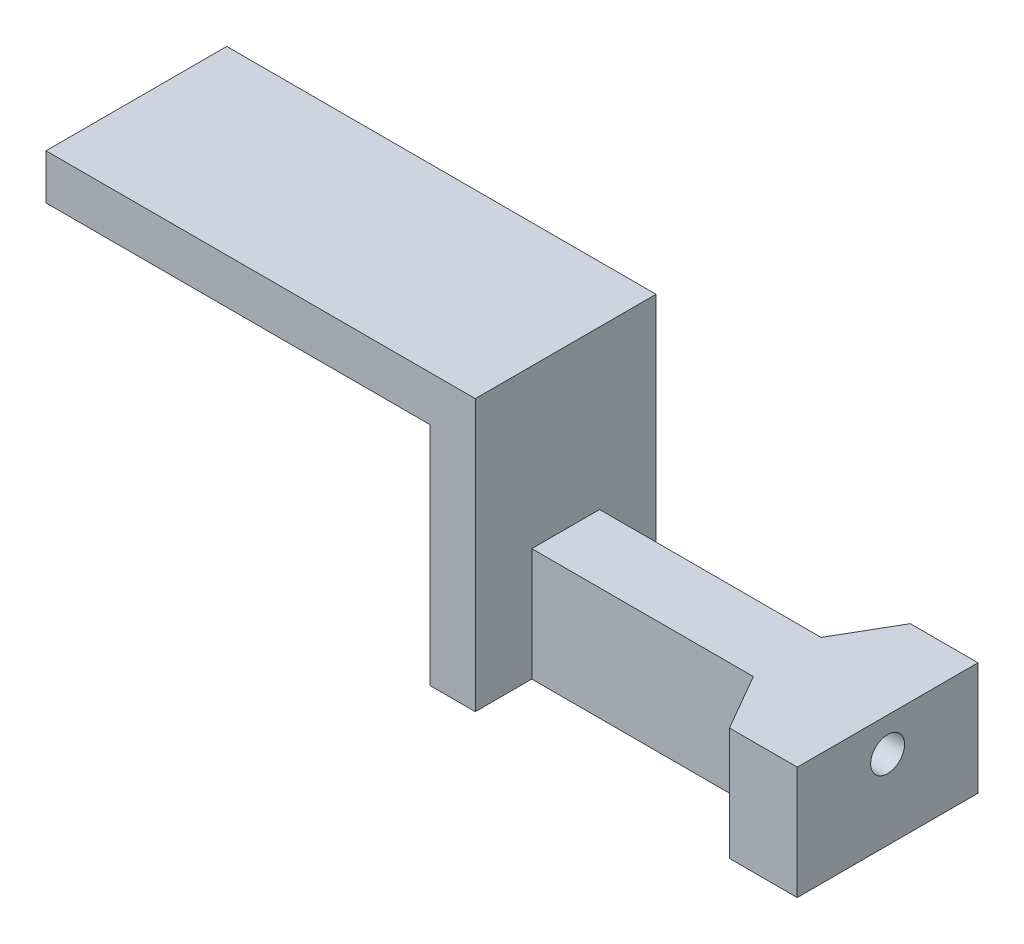
ISO-10303-21;
HEADER;
FILE_DESCRIPTION(('STEP AP214'),'2;1');
FILE_NAME('part.step','',(''),(''),'','','');
FILE_SCHEMA(('AUTOMOTIVE_DESIGN { 1 0 10303 214 1 1 1 1 }'));
ENDSEC;
DATA;
#1=APPLICATION_CONTEXT('core data for automotive mechanical design processes');
#2=APPLICATION_PROTOCOL_DEFINITION('international standard','automotive_design',2000,#1);
#3=PRODUCT_CONTEXT('',#1,'mechanical');
#4=PRODUCT('Part','Part','',(#3));
#5=PRODUCT_RELATED_PRODUCT_CATEGORY('part','',(#4));
#6=PRODUCT_DEFINITION_FORMATION('','',#4);
#7=PRODUCT_DEFINITION_CONTEXT('part definition',#1,'design');
#8=PRODUCT_DEFINITION('design','',#6,#7);
#9=PRODUCT_DEFINITION_SHAPE('','',#8);
#10=(LENGTH_UNIT() NAMED_UNIT(*) SI_UNIT(.MILLI.,.METRE.));
#11=(NAMED_UNIT(*) PLANE_ANGLE_UNIT() SI_UNIT($,.RADIAN.));
#12=(NAMED_UNIT(*) SI_UNIT($,.STERADIAN.) SOLID_ANGLE_UNIT());
#13=UNCERTAINTY_MEASURE_WITH_UNIT(LENGTH_MEASURE(1.E-05),#10,'distance_accuracy_value','');
#14=(GEOMETRIC_REPRESENTATION_CONTEXT(3) GLOBAL_UNCERTAINTY_ASSIGNED_CONTEXT((#13)) GLOBAL_UNIT_ASSIGNED_CONTEXT((#10,
#11,#12)) REPRESENTATION_CONTEXT('',''));
#15=CARTESIAN_POINT('',(0.,0.,0.));
#16=DIRECTION('',(0.,0.,1.));
#17=DIRECTION('',(1.,0.,0.));
#18=AXIS2_PLACEMENT_3D('',#15,#16,#17);
#19=CARTESIAN_POINT('',(10.5,-4.5,4.));
#20=DIRECTION('',(-1.,0.,0.));
#21=DIRECTION('',(0.,0.,1.));
#22=AXIS2_PLACEMENT_3D('',#19,#20,#21);
#23=PLANE('',#22);
#24=DIRECTION('',(0.,-1.,0.));
#25=VECTOR('',#24,1.);
#26=CARTESIAN_POINT('',(10.5,-4.5,1.5));
#27=LINE('',#26,#25);
#28=CARTESIAN_POINT('',(10.5,-2.5,1.5));
#29=VERTEX_POINT('',#28);
#30=CARTESIAN_POINT('',(10.5,-7.5,1.5));
#31=VERTEX_POINT('',#30);
#32=EDGE_CURVE('E254',#29,#31,#27,.T.);
#33=ORIENTED_EDGE('',*,*,#32,.F.);
#34=DIRECTION('',(0.,0.,1.));
#35=VECTOR('',#34,1.);
#36=CARTESIAN_POINT('',(10.5,-2.5,4.));
#37=LINE('',#36,#35);
#38=CARTESIAN_POINT('',(10.5,-2.5,-1.5));
#39=VERTEX_POINT('',#38);
#40=EDGE_CURVE('E260',#39,#29,#37,.T.);
#41=ORIENTED_EDGE('',*,*,#40,.F.);
#42=DIRECTION('',(0.,1.,0.));
#43=VECTOR('',#42,1.);
#44=CARTESIAN_POINT('',(10.5,-4.5,-1.5));
#45=LINE('',#44,#43);
#46=CARTESIAN_POINT('',(10.5,-7.5,-1.5));
#47=VERTEX_POINT('',#46);
#48=EDGE_CURVE('E257',#47,#39,#45,.T.);
#49=ORIENTED_EDGE('',*,*,#48,.F.);
#50=DIRECTION('',(0.,0.,1.));
#51=VECTOR('',#50,1.);
#52=CARTESIAN_POINT('',(10.5,-7.5,-7.60555127546399));
#53=LINE('',#52,#51);
#54=CARTESIAN_POINT('',(10.5,-7.5,-4.));
#55=VERTEX_POINT('',#54);
#56=EDGE_CURVE('E272',#55,#47,#53,.T.);
#57=ORIENTED_EDGE('',*,*,#56,.F.);
#58=DIRECTION('',(0.,1.,0.));
#59=VECTOR('',#58,1.);
#60=CARTESIAN_POINT('',(10.5,-4.5,-4.));
#61=LINE('',#60,#59);
#62=CARTESIAN_POINT('',(10.5,4.5,-4.));
#63=VERTEX_POINT('',#62);
#64=EDGE_CURVE('E312',#55,#63,#61,.T.);
#65=ORIENTED_EDGE('',*,*,#64,.T.);
#66=DIRECTION('',(0.,0.,-1.));
#67=VECTOR('',#66,1.);
#68=CARTESIAN_POINT('',(10.5,4.5,4.));
#69=LINE('',#68,#67);
#70=CARTESIAN_POINT('',(10.5,4.5,4.));
#71=VERTEX_POINT('',#70);
#72=EDGE_CURVE('E314',#71,#63,#69,.T.);
#73=ORIENTED_EDGE('',*,*,#72,.F.);
#74=DIRECTION('',(0.,1.,0.));
#75=VECTOR('',#74,1.);
#76=CARTESIAN_POINT('',(10.5,-4.5,4.));
#77=LINE('',#76,#75);
#78=CARTESIAN_POINT('',(10.5,-7.5,4.));
#79=VERTEX_POINT('',#78);
#80=EDGE_CURVE('E311',#79,#71,#77,.T.);
#81=ORIENTED_EDGE('',*,*,#80,.F.);
#82=EDGE_CURVE('E174',#31,#79,#53,.T.);
#83=ORIENTED_EDGE('',*,*,#82,.F.);
#84=EDGE_LOOP('',(#33,#41,#49,#57,#65,#73,#81,#83));
#85=FACE_BOUND('',#84,.T.);
#86=ADVANCED_FACE('F34',(#85),#23,.F.);
#87=CARTESIAN_POINT('',(-8.5,2.5,-4.001));
#88=DIRECTION('',(0.,1.,0.));
#89=DIRECTION('',(0.,0.,1.));
#90=AXIS2_PLACEMENT_3D('',#87,#88,#89);
#91=PLANE('',#90);
#92=DIRECTION('',(-1.,0.,0.));
#93=VECTOR('',#92,1.);
#94=CARTESIAN_POINT('',(500000.,2.5,1.));
#95=LINE('',#94,#93);
#96=CARTESIAN_POINT('',(6.7679491924757,2.49999999999886,0.999999999995282));
#97=VERTEX_POINT('',#96);
#98=CARTESIAN_POINT('',(-8.5,2.5,1.));
#99=VERTEX_POINT('',#98);
#100=EDGE_CURVE('E282',#97,#99,#95,.T.);
#101=ORIENTED_EDGE('',*,*,#100,.F.);
#102=DIRECTION('',(0.499999999999995,0.,0.866025403784442));
#103=VECTOR('',#102,1.);
#104=CARTESIAN_POINT('',(0.785465372160472,2.5,-9.36196593216772));
#105=LINE('',#104,#103);
#106=CARTESIAN_POINT('',(8.5,2.5,4.));
#107=VERTEX_POINT('',#106);
#108=EDGE_CURVE('E204',#97,#107,#105,.T.);
#109=ORIENTED_EDGE('',*,*,#108,.T.);
#110=DIRECTION('',(-1.,0.,0.));
#111=VECTOR('',#110,1.);
#112=CARTESIAN_POINT('',(-8.5,2.5,4.));
#113=LINE('',#112,#111);
#114=CARTESIAN_POINT('',(-8.5,2.5,4.));
#115=VERTEX_POINT('',#114);
#116=EDGE_CURVE('E186',#107,#115,#113,.T.);
#117=ORIENTED_EDGE('',*,*,#116,.T.);
#118=DIRECTION('',(0.,0.,1.));
#119=VECTOR('',#118,1.);
#120=CARTESIAN_POINT('',(-8.5,2.5,-4.001));
#121=LINE('',#120,#119);
#122=EDGE_CURVE('E304',#99,#115,#121,.T.);
#123=ORIENTED_EDGE('',*,*,#122,.F.);
#124=EDGE_LOOP('',(#101,#109,#117,#123));
#125=FACE_BOUND('',#124,.T.);
#126=ADVANCED_FACE('F388',(#125),#91,.F.);
#127=CARTESIAN_POINT('',(-10.5,4.5,4.));
#128=DIRECTION('',(0.,1.,0.));
#129=DIRECTION('',(0.,0.,1.));
#130=AXIS2_PLACEMENT_3D('',#127,#128,#129);
#131=PLANE('',#130);
#132=ORIENTED_EDGE('',*,*,#72,.T.);
#133=DIRECTION('',(1.,0.,0.));
#134=VECTOR('',#133,1.);
#135=CARTESIAN_POINT('',(-10.5,4.5,-4.));
#136=LINE('',#135,#134);
#137=CARTESIAN_POINT('',(-8.5,4.5,-4.));
#138=VERTEX_POINT('',#137);
#139=EDGE_CURVE('E308',#138,#63,#136,.T.);
#140=ORIENTED_EDGE('',*,*,#139,.F.);
#141=DIRECTION('',(0.,0.,1.));
#142=VECTOR('',#141,1.);
#143=CARTESIAN_POINT('',(-8.5,4.5,-4.001));
#144=LINE('',#143,#142);
#145=CARTESIAN_POINT('',(-8.5,4.5,4.));
#146=VERTEX_POINT('',#145);
#147=EDGE_CURVE('E296',#138,#146,#144,.T.);
#148=ORIENTED_EDGE('',*,*,#147,.T.);
#149=DIRECTION('',(1.,0.,0.));
#150=VECTOR('',#149,1.);
#151=CARTESIAN_POINT('',(-10.5,4.5,4.));
#152=LINE('',#151,#150);
#153=EDGE_CURVE('E309',#146,#71,#152,.T.);
#154=ORIENTED_EDGE('',*,*,#153,.T.);
#155=EDGE_LOOP('',(#132,#140,#148,#154));
#156=FACE_BOUND('',#155,.T.);
#157=ADVANCED_FACE('F36',(#156),#131,.T.);
#158=CARTESIAN_POINT('',(0.,0.,4.));
#159=DIRECTION('',(0.,0.,1.));
#160=DIRECTION('',(1.,0.,0.));
#161=AXIS2_PLACEMENT_3D('',#158,#159,#160);
#162=PLANE('',#161);
#163=ORIENTED_EDGE('',*,*,#116,.F.);
#164=DIRECTION('',(0.,1.,0.));
#165=VECTOR('',#164,1.);
#166=CARTESIAN_POINT('',(8.5,-4.5,4.));
#167=LINE('',#166,#165);
#168=CARTESIAN_POINT('',(8.5,-7.5,4.));
#169=VERTEX_POINT('',#168);
#170=EDGE_CURVE('E182',#169,#107,#167,.T.);
#171=ORIENTED_EDGE('',*,*,#170,.F.);
#172=DIRECTION('',(1.,0.,0.));
#173=VECTOR('',#172,1.);
#174=CARTESIAN_POINT('',(0.,-7.5,4.));
#175=LINE('',#174,#173);
#176=EDGE_CURVE('E166',#169,#79,#175,.T.);
#177=ORIENTED_EDGE('',*,*,#176,.T.);
#178=ORIENTED_EDGE('',*,*,#80,.T.);
#179=ORIENTED_EDGE('',*,*,#153,.F.);
#180=DIRECTION('',(0.,1.,0.));
#181=VECTOR('',#180,1.);
#182=CARTESIAN_POINT('',(-8.5,4.5,4.));
#183=LINE('',#182,#181);
#184=EDGE_CURVE('E294',#115,#146,#183,.T.);
#185=ORIENTED_EDGE('',*,*,#184,.F.);
#186=EDGE_LOOP('',(#163,#171,#177,#178,#179,#185));
#187=FACE_BOUND('',#186,.T.);
#188=ADVANCED_FACE('F183',(#187),#162,.T.);
#189=CARTESIAN_POINT('',(0.,0.,-4.));
#190=DIRECTION('',(0.,0.,1.));
#191=DIRECTION('',(1.,0.,0.));
#192=AXIS2_PLACEMENT_3D('',#189,#190,#191);
#193=PLANE('',#192);
#194=DIRECTION('',(0.,-1.,0.));
#195=VECTOR('',#194,1.);
#196=CARTESIAN_POINT('',(8.5,-4.5,-4.));
#197=LINE('',#196,#195);
#198=CARTESIAN_POINT('',(8.5,2.5,-4.));
#199=VERTEX_POINT('',#198);
#200=CARTESIAN_POINT('',(8.5,-7.5,-4.));
#201=VERTEX_POINT('',#200);
#202=EDGE_CURVE('E299',#199,#201,#197,.T.);
#203=ORIENTED_EDGE('',*,*,#202,.F.);
#204=DIRECTION('',(1.,0.,0.));
#205=VECTOR('',#204,1.);
#206=CARTESIAN_POINT('',(-8.5,2.5,-4.));
#207=LINE('',#206,#205);
#208=CARTESIAN_POINT('',(-8.5,2.5,-4.));
#209=VERTEX_POINT('',#208);
#210=EDGE_CURVE('E189',#209,#199,#207,.T.);
#211=ORIENTED_EDGE('',*,*,#210,.F.);
#212=DIRECTION('',(0.,-1.,0.));
#213=VECTOR('',#212,1.);
#214=CARTESIAN_POINT('',(-8.5,4.5,-4.));
#215=LINE('',#214,#213);
#216=EDGE_CURVE('E292',#138,#209,#215,.T.);
#217=ORIENTED_EDGE('',*,*,#216,.F.);
#218=ORIENTED_EDGE('',*,*,#139,.T.);
#219=ORIENTED_EDGE('',*,*,#64,.F.);
#220=DIRECTION('',(-1.,0.,0.));
#221=VECTOR('',#220,1.);
#222=CARTESIAN_POINT('',(0.,-7.5,-4.));
#223=LINE('',#222,#221);
#224=EDGE_CURVE('E270',#55,#201,#223,.T.);
#225=ORIENTED_EDGE('',*,*,#224,.T.);
#226=EDGE_LOOP('',(#203,#211,#217,#218,#219,#225));
#227=FACE_BOUND('',#226,.T.);
#228=ADVANCED_FACE('F339',(#227),#193,.F.);
#229=ORIENTED_EDGE('',*,*,#210,.T.);
#230=DIRECTION('',(-0.499999999999995,0.,0.866025403784442));
#231=VECTOR('',#230,1.);
#232=CARTESIAN_POINT('',(4.25043301270198,2.5,3.36046593216768));
#233=LINE('',#232,#231);
#234=CARTESIAN_POINT('',(6.76794919243306,2.50000000000597,-1.00000000000239));
#235=VERTEX_POINT('',#234);
#236=EDGE_CURVE('E201',#199,#235,#233,.T.);
#237=ORIENTED_EDGE('',*,*,#236,.T.);
#238=DIRECTION('',(-1.,0.,0.));
#239=VECTOR('',#238,1.);
#240=CARTESIAN_POINT('',(500000.,2.5,-1.));
#241=LINE('',#240,#239);
#242=CARTESIAN_POINT('',(-8.5,2.5,-1.));
#243=VERTEX_POINT('',#242);
#244=EDGE_CURVE('E290',#235,#243,#241,.T.);
#245=ORIENTED_EDGE('',*,*,#244,.T.);
#246=EDGE_CURVE('E305',#209,#243,#121,.T.);
#247=ORIENTED_EDGE('',*,*,#246,.F.);
#248=EDGE_LOOP('',(#229,#237,#245,#247));
#249=FACE_BOUND('',#248,.T.);
#250=ADVANCED_FACE('F336',(#249),#91,.F.);
#251=CARTESIAN_POINT('',(-8.5,4.5,-4.001));
#252=DIRECTION('',(1.,0.,0.));
#253=DIRECTION('',(0.,0.,-1.));
#254=AXIS2_PLACEMENT_3D('',#251,#252,#253);
#255=PLANE('',#254);
#256=ORIENTED_EDGE('',*,*,#184,.T.);
#257=ORIENTED_EDGE('',*,*,#147,.F.);
#258=ORIENTED_EDGE('',*,*,#216,.T.);
#259=ORIENTED_EDGE('',*,*,#246,.T.);
#260=DIRECTION('',(0.,-0.894427190999916,-0.447213595499958));
#261=VECTOR('',#260,1.);
#262=CARTESIAN_POINT('',(-8.5,0.9,-1.8));
#263=LINE('',#262,#261);
#264=CARTESIAN_POINT('',(-8.5,1.,-1.75));
#265=VERTEX_POINT('',#264);
#266=EDGE_CURVE('E271',#243,#265,#263,.T.);
#267=ORIENTED_EDGE('',*,*,#266,.T.);
#268=DIRECTION('',(0.,0.,-1.));
#269=VECTOR('',#268,1.);
#270=CARTESIAN_POINT('',(-8.5,1.,0.));
#271=LINE('',#270,#269);
#272=CARTESIAN_POINT('',(-8.5,1.,1.75));
#273=VERTEX_POINT('',#272);
#274=EDGE_CURVE('E276',#273,#265,#271,.T.);
#275=ORIENTED_EDGE('',*,*,#274,.F.);
#276=DIRECTION('',(0.,-0.894427190999916,0.447213595499958));
#277=VECTOR('',#276,1.);
#278=CARTESIAN_POINT('',(-8.5,0.900000000000001,1.8));
#279=LINE('',#278,#277);
#280=EDGE_CURVE('E279',#99,#273,#279,.T.);
#281=ORIENTED_EDGE('',*,*,#280,.F.);
#282=ORIENTED_EDGE('',*,*,#122,.T.);
#283=EDGE_LOOP('',(#256,#257,#258,#259,#267,#275,#281,#282));
#284=FACE_BOUND('',#283,.T.);
#285=ADVANCED_FACE('F331',(#284),#255,.F.);
#286=CARTESIAN_POINT('',(500000.,0.900000000000001,1.8));
#287=DIRECTION('',(0.,-0.447213595499958,-0.894427190999916));
#288=DIRECTION('',(0.,0.894427190999916,-0.447213595499958));
#289=AXIS2_PLACEMENT_3D('',#286,#287,#288);
#290=PLANE('',#289);
#291=DIRECTION('',(-1.,0.,0.));
#292=VECTOR('',#291,1.);
#293=CARTESIAN_POINT('',(500000.,1.,1.75));
#294=LINE('',#293,#292);
#295=CARTESIAN_POINT('',(7.20096189438379,1.,1.75000000000773));
#296=VERTEX_POINT('',#295);
#297=EDGE_CURVE('E286',#296,#273,#294,.T.);
#298=ORIENTED_EDGE('',*,*,#297,.F.);
#299=DIRECTION('',(-0.249999999999997,0.866025403784439,-0.43301270189222));
#300=VECTOR('',#299,1.);
#301=CARTESIAN_POINT('',(31256.777965069,-108250.71016907,54127.6050845353));
#302=LINE('',#301,#300);
#303=EDGE_CURVE('E49',#296,#97,#302,.T.);
#304=ORIENTED_EDGE('',*,*,#303,.T.);
#305=ORIENTED_EDGE('',*,*,#100,.T.);
#306=ORIENTED_EDGE('',*,*,#280,.T.);
#307=EDGE_LOOP('',(#298,#304,#305,#306));
#308=FACE_BOUND('',#307,.T.);
#309=ADVANCED_FACE('F402',(#308),#290,.F.);
#310=CARTESIAN_POINT('',(500000.,1.,0.));
#311=DIRECTION('',(0.,1.,0.));
#312=DIRECTION('',(0.,0.,1.));
#313=AXIS2_PLACEMENT_3D('',#310,#311,#312);
#314=PLANE('',#313);
#315=DIRECTION('',(-1.,0.,0.));
#316=VECTOR('',#315,1.);
#317=CARTESIAN_POINT('',(500000.,1.,-1.75));
#318=LINE('',#317,#316);
#319=CARTESIAN_POINT('',(7.20096189428432,1.0000000000237,-1.74999999999352));
#320=VERTEX_POINT('',#319);
#321=EDGE_CURVE('E288',#320,#265,#318,.T.);
#322=ORIENTED_EDGE('',*,*,#321,.F.);
#323=DIRECTION('',(-0.499999999999995,0.,0.866025403784442));
#324=VECTOR('',#323,1.);
#325=CARTESIAN_POINT('',(125004.64294919,0.999999999973174,-216503.670338142));
#326=LINE('',#325,#324);
#327=CARTESIAN_POINT('',(6.19059892322582,1.,0.));
#328=VERTEX_POINT('',#327);
#329=EDGE_CURVE('E56',#320,#328,#326,.T.);
#330=ORIENTED_EDGE('',*,*,#329,.T.);
#331=DIRECTION('',(0.499999999999995,0.,0.866025403784442));
#332=VECTOR('',#331,1.);
#333=CARTESIAN_POINT('',(125004.64294919,1.00000000002683,216503.670338142));
#334=LINE('',#333,#332);
#335=EDGE_CURVE('E11',#328,#296,#334,.T.);
#336=ORIENTED_EDGE('',*,*,#335,.T.);
#337=ORIENTED_EDGE('',*,*,#297,.T.);
#338=ORIENTED_EDGE('',*,*,#274,.T.);
#339=EDGE_LOOP('',(#322,#330,#336,#337,#338));
#340=FACE_BOUND('',#339,.T.);
#341=ADVANCED_FACE('F327',(#340),#314,.F.);
#342=CARTESIAN_POINT('',(500000.,0.9,-1.8));
#343=DIRECTION('',(0.,0.447213595499958,-0.894427190999916));
#344=DIRECTION('',(0.,0.894427190999916,0.447213595499958));
#345=AXIS2_PLACEMENT_3D('',#342,#343,#344);
#346=PLANE('',#345);
#347=DIRECTION('',(-0.249999999999997,0.866025403784439,0.43301270189222));
#348=VECTOR('',#347,1.);
#349=CARTESIAN_POINT('',(31256.777965069,-108250.71016907,-54127.6050845352));
#350=LINE('',#349,#348);
#351=EDGE_CURVE('E42',#320,#235,#350,.T.);
#352=ORIENTED_EDGE('',*,*,#351,.F.);
#353=ORIENTED_EDGE('',*,*,#321,.T.);
#354=ORIENTED_EDGE('',*,*,#266,.F.);
#355=ORIENTED_EDGE('',*,*,#244,.F.);
#356=EDGE_LOOP('',(#352,#353,#354,#355));
#357=FACE_BOUND('',#356,.T.);
#358=ADVANCED_FACE('F325',(#357),#346,.T.);
#359=CARTESIAN_POINT('',(0.,-7.5,-7.60555127546399));
#360=DIRECTION('',(0.,-1.,0.));
#361=DIRECTION('',(0.,0.,-1.));
#362=AXIS2_PLACEMENT_3D('',#359,#360,#361);
#363=PLANE('',#362);
#364=DIRECTION('',(-1.,0.,0.));
#365=VECTOR('',#364,1.);
#366=CARTESIAN_POINT('',(21.75,-7.5,-1.5));
#367=LINE('',#366,#365);
#368=CARTESIAN_POINT('',(20.306624327026,-7.5,-1.5));
#369=VERTEX_POINT('',#368);
#370=EDGE_CURVE('E267',#369,#47,#367,.T.);
#371=ORIENTED_EDGE('',*,*,#370,.F.);
#372=DIRECTION('',(0.499999999999995,0.,-0.866025403784442));
#373=VECTOR('',#372,1.);
#374=CARTESIAN_POINT('',(20.306624327026,-7.5,-1.5));
#375=LINE('',#374,#373);
#376=CARTESIAN_POINT('',(21.75,-7.5,-4.));
#377=VERTEX_POINT('',#376);
#378=EDGE_CURVE('E206',#369,#377,#375,.T.);
#379=ORIENTED_EDGE('',*,*,#378,.T.);
#380=DIRECTION('',(-1.,0.,0.));
#381=VECTOR('',#380,1.);
#382=CARTESIAN_POINT('',(24.75,-7.5,-4.));
#383=LINE('',#382,#381);
#384=CARTESIAN_POINT('',(24.75,-7.5,-4.));
#385=VERTEX_POINT('',#384);
#386=EDGE_CURVE('E248',#385,#377,#383,.T.);
#387=ORIENTED_EDGE('',*,*,#386,.F.);
#388=DIRECTION('',(0.,0.,-1.));
#389=VECTOR('',#388,1.);
#390=CARTESIAN_POINT('',(24.75,-7.5,4.));
#391=LINE('',#390,#389);
#392=CARTESIAN_POINT('',(24.75,-7.5,4.));
#393=VERTEX_POINT('',#392);
#394=EDGE_CURVE('E231',#393,#385,#391,.T.);
#395=ORIENTED_EDGE('',*,*,#394,.F.);
#396=DIRECTION('',(-1.,0.,0.));
#397=VECTOR('',#396,1.);
#398=CARTESIAN_POINT('',(24.75,-7.5,4.));
#399=LINE('',#398,#397);
#400=CARTESIAN_POINT('',(21.75,-7.5,4.));
#401=VERTEX_POINT('',#400);
#402=EDGE_CURVE('E251',#393,#401,#399,.T.);
#403=ORIENTED_EDGE('',*,*,#402,.T.);
#404=DIRECTION('',(-0.499999999999995,0.,-0.866025403784442));
#405=VECTOR('',#404,1.);
#406=CARTESIAN_POINT('',(21.75,-7.5,4.));
#407=LINE('',#406,#405);
#408=CARTESIAN_POINT('',(20.306624327026,-7.5,1.5));
#409=VERTEX_POINT('',#408);
#410=EDGE_CURVE('E209',#401,#409,#407,.T.);
#411=ORIENTED_EDGE('',*,*,#410,.T.);
#412=DIRECTION('',(-1.,0.,0.));
#413=VECTOR('',#412,1.);
#414=CARTESIAN_POINT('',(21.75,-7.5,1.5));
#415=LINE('',#414,#413);
#416=EDGE_CURVE('E178',#409,#31,#415,.T.);
#417=ORIENTED_EDGE('',*,*,#416,.T.);
#418=ORIENTED_EDGE('',*,*,#82,.T.);
#419=ORIENTED_EDGE('',*,*,#176,.F.);
#420=DIRECTION('',(-0.499999999999995,0.,-0.866025403784442));
#421=VECTOR('',#420,1.);
#422=CARTESIAN_POINT('',(6.19059892324153,-7.5,0.));
#423=LINE('',#422,#421);
#424=CARTESIAN_POINT('',(6.19059892324153,-7.5,0.));
#425=VERTEX_POINT('',#424);
#426=EDGE_CURVE('E172',#169,#425,#423,.T.);
#427=ORIENTED_EDGE('',*,*,#426,.T.);
#428=DIRECTION('',(0.499999999999995,0.,-0.866025403784442));
#429=VECTOR('',#428,1.);
#430=CARTESIAN_POINT('',(8.5,-7.5,-4.));
#431=LINE('',#430,#429);
#432=EDGE_CURVE('E195',#425,#201,#431,.T.);
#433=ORIENTED_EDGE('',*,*,#432,.T.);
#434=ORIENTED_EDGE('',*,*,#224,.F.);
#435=ORIENTED_EDGE('',*,*,#56,.T.);
#436=EDGE_LOOP('',(#371,#379,#387,#395,#403,#411,#417,#418,#419,#427,#433,#434,#435));
#437=FACE_BOUND('',#436,.T.);
#438=ADVANCED_FACE('F169',(#437),#363,.T.);
#439=CARTESIAN_POINT('',(21.75,-4.5,1.5));
#440=DIRECTION('',(0.,0.,-1.));
#441=DIRECTION('',(-1.,0.,0.));
#442=AXIS2_PLACEMENT_3D('',#439,#440,#441);
#443=PLANE('',#442);
#444=ORIENTED_EDGE('',*,*,#416,.F.);
#445=DIRECTION('',(0.,-1.,0.));
#446=VECTOR('',#445,1.);
#447=CARTESIAN_POINT('',(20.306624327026,0.386751345948117,1.5));
#448=LINE('',#447,#446);
#449=CARTESIAN_POINT('',(20.306624327026,-2.5,1.5));
#450=VERTEX_POINT('',#449);
#451=EDGE_CURVE('E217',#450,#409,#448,.T.);
#452=ORIENTED_EDGE('',*,*,#451,.F.);
#453=DIRECTION('',(-1.,0.,0.));
#454=VECTOR('',#453,1.);
#455=CARTESIAN_POINT('',(21.75,-2.5,1.5));
#456=LINE('',#455,#454);
#457=EDGE_CURVE('E263',#450,#29,#456,.T.);
#458=ORIENTED_EDGE('',*,*,#457,.T.);
#459=ORIENTED_EDGE('',*,*,#32,.T.);
#460=EDGE_LOOP('',(#444,#452,#458,#459));
#461=FACE_BOUND('',#460,.T.);
#462=ADVANCED_FACE('F373',(#461),#443,.F.);
#463=CARTESIAN_POINT('',(21.75,-4.5,-1.5));
#464=DIRECTION('',(0.,0.,1.));
#465=DIRECTION('',(1.,0.,0.));
#466=AXIS2_PLACEMENT_3D('',#463,#464,#465);
#467=PLANE('',#466);
#468=DIRECTION('',(-1.,0.,0.));
#469=VECTOR('',#468,1.);
#470=CARTESIAN_POINT('',(21.75,-2.5,-1.5));
#471=LINE('',#470,#469);
#472=CARTESIAN_POINT('',(20.306624327026,-2.5,-1.5));
#473=VERTEX_POINT('',#472);
#474=EDGE_CURVE('E265',#473,#39,#471,.T.);
#475=ORIENTED_EDGE('',*,*,#474,.F.);
#476=DIRECTION('',(0.,-1.,0.));
#477=VECTOR('',#476,1.);
#478=CARTESIAN_POINT('',(20.306624327026,0.386751345948117,-1.5));
#479=LINE('',#478,#477);
#480=EDGE_CURVE('E210',#473,#369,#479,.T.);
#481=ORIENTED_EDGE('',*,*,#480,.T.);
#482=ORIENTED_EDGE('',*,*,#370,.T.);
#483=ORIENTED_EDGE('',*,*,#48,.T.);
#484=EDGE_LOOP('',(#475,#481,#482,#483));
#485=FACE_BOUND('',#484,.T.);
#486=ADVANCED_FACE('F350',(#485),#467,.F.);
#487=CARTESIAN_POINT('',(21.75,-2.5,4.));
#488=DIRECTION('',(0.,-1.,0.));
#489=DIRECTION('',(0.,0.,-1.));
#490=AXIS2_PLACEMENT_3D('',#487,#488,#489);
#491=PLANE('',#490);
#492=DIRECTION('',(-0.499999999999995,0.,0.866025403784442));
#493=VECTOR('',#492,1.);
#494=CARTESIAN_POINT('',(20.306624327026,-2.5,-1.5));
#495=LINE('',#494,#493);
#496=CARTESIAN_POINT('',(21.75,-2.5,-4.));
#497=VERTEX_POINT('',#496);
#498=EDGE_CURVE('E207',#497,#473,#495,.T.);
#499=ORIENTED_EDGE('',*,*,#498,.T.);
#500=ORIENTED_EDGE('',*,*,#474,.T.);
#501=ORIENTED_EDGE('',*,*,#40,.T.);
#502=ORIENTED_EDGE('',*,*,#457,.F.);
#503=DIRECTION('',(0.499999999999995,0.,0.866025403784442));
#504=VECTOR('',#503,1.);
#505=CARTESIAN_POINT('',(21.75,-2.5,4.));
#506=LINE('',#505,#504);
#507=CARTESIAN_POINT('',(21.75,-2.5,4.));
#508=VERTEX_POINT('',#507);
#509=EDGE_CURVE('E219',#450,#508,#506,.T.);
#510=ORIENTED_EDGE('',*,*,#509,.T.);
#511=DIRECTION('',(-1.,0.,0.));
#512=VECTOR('',#511,1.);
#513=CARTESIAN_POINT('',(24.75,-2.5,4.));
#514=LINE('',#513,#512);
#515=CARTESIAN_POINT('',(24.75,-2.5,4.));
#516=VERTEX_POINT('',#515);
#517=EDGE_CURVE('E238',#516,#508,#514,.T.);
#518=ORIENTED_EDGE('',*,*,#517,.F.);
#519=DIRECTION('',(0.,0.,1.));
#520=VECTOR('',#519,1.);
#521=CARTESIAN_POINT('',(24.75,-2.5,4.));
#522=LINE('',#521,#520);
#523=CARTESIAN_POINT('',(24.75,-2.5,-4.));
#524=VERTEX_POINT('',#523);
#525=EDGE_CURVE('E236',#524,#516,#522,.T.);
#526=ORIENTED_EDGE('',*,*,#525,.F.);
#527=DIRECTION('',(-1.,0.,0.));
#528=VECTOR('',#527,1.);
#529=CARTESIAN_POINT('',(24.75,-2.5,-4.));
#530=LINE('',#529,#528);
#531=EDGE_CURVE('E245',#524,#497,#530,.T.);
#532=ORIENTED_EDGE('',*,*,#531,.T.);
#533=EDGE_LOOP('',(#499,#500,#501,#502,#510,#518,#526,#532));
#534=FACE_BOUND('',#533,.T.);
#535=ADVANCED_FACE('F375',(#534),#491,.F.);
#536=CARTESIAN_POINT('',(24.75,-2.5,4.));
#537=DIRECTION('',(0.,0.,-1.));
#538=DIRECTION('',(0.,1.,0.));
#539=AXIS2_PLACEMENT_3D('',#536,#537,#538);
#540=PLANE('',#539);
#541=DIRECTION('',(0.,-1.,0.));
#542=VECTOR('',#541,1.);
#543=CARTESIAN_POINT('',(21.75,-2.5,4.));
#544=LINE('',#543,#542);
#545=EDGE_CURVE('E225',#508,#401,#544,.T.);
#546=ORIENTED_EDGE('',*,*,#545,.T.);
#547=ORIENTED_EDGE('',*,*,#402,.F.);
#548=DIRECTION('',(0.,-1.,0.));
#549=VECTOR('',#548,1.);
#550=CARTESIAN_POINT('',(24.75,-2.5,4.));
#551=LINE('',#550,#549);
#552=EDGE_CURVE('E228',#516,#393,#551,.T.);
#553=ORIENTED_EDGE('',*,*,#552,.F.);
#554=ORIENTED_EDGE('',*,*,#517,.T.);
#555=EDGE_LOOP('',(#546,#547,#553,#554));
#556=FACE_BOUND('',#555,.T.);
#557=ADVANCED_FACE('F367',(#556),#540,.F.);
#558=CARTESIAN_POINT('',(24.75,-2.5,-4.));
#559=DIRECTION('',(0.,0.,1.));
#560=DIRECTION('',(0.,-1.,0.));
#561=AXIS2_PLACEMENT_3D('',#558,#559,#560);
#562=PLANE('',#561);
#563=DIRECTION('',(0.,1.,0.));
#564=VECTOR('',#563,1.);
#565=CARTESIAN_POINT('',(21.75,-2.5,-4.));
#566=LINE('',#565,#564);
#567=EDGE_CURVE('E232',#377,#497,#566,.T.);
#568=ORIENTED_EDGE('',*,*,#567,.T.);
#569=ORIENTED_EDGE('',*,*,#531,.F.);
#570=DIRECTION('',(0.,1.,0.));
#571=VECTOR('',#570,1.);
#572=CARTESIAN_POINT('',(24.75,-2.5,-4.));
#573=LINE('',#572,#571);
#574=EDGE_CURVE('E234',#385,#524,#573,.T.);
#575=ORIENTED_EDGE('',*,*,#574,.F.);
#576=ORIENTED_EDGE('',*,*,#386,.T.);
#577=EDGE_LOOP('',(#568,#569,#575,#576));
#578=FACE_BOUND('',#577,.T.);
#579=ADVANCED_FACE('F356',(#578),#562,.F.);
#580=CARTESIAN_POINT('',(24.75,0.,0.));
#581=DIRECTION('',(1.,0.,0.));
#582=DIRECTION('',(0.,0.,-1.));
#583=AXIS2_PLACEMENT_3D('',#580,#581,#582);
#584=PLANE('',#583);
#585=CARTESIAN_POINT('',(24.75,-4.,0.));
#586=DIRECTION('',(1.,0.,0.));
#587=DIRECTION('',(0.,0.,-1.));
#588=AXIS2_PLACEMENT_3D('',#585,#586,#587);
#589=CIRCLE('',#588,0.75);
#590=CARTESIAN_POINT('',(24.75,-4.,-0.75));
#591=VERTEX_POINT('',#590);
#592=EDGE_CURVE('E221',#591,#591,#589,.T.);
#593=ORIENTED_EDGE('',*,*,#592,.F.);
#594=EDGE_LOOP('',(#593));
#595=FACE_BOUND('',#594,.T.);
#596=ORIENTED_EDGE('',*,*,#552,.T.);
#597=ORIENTED_EDGE('',*,*,#394,.T.);
#598=ORIENTED_EDGE('',*,*,#574,.T.);
#599=ORIENTED_EDGE('',*,*,#525,.T.);
#600=EDGE_LOOP('',(#596,#597,#598,#599));
#601=FACE_BOUND('',#600,.T.);
#602=ADVANCED_FACE('F360',(#595,#601),#584,.T.);
#603=CARTESIAN_POINT('',(22.25,-4.,0.));
#604=DIRECTION('',(1.,0.,0.));
#605=DIRECTION('',(0.,0.,-1.));
#606=AXIS2_PLACEMENT_3D('',#603,#604,#605);
#607=CYLINDRICAL_SURFACE('',#606,0.75);
#608=CARTESIAN_POINT('',(22.25,-4.,0.));
#609=DIRECTION('',(1.,0.,0.));
#610=DIRECTION('',(0.,0.,-1.));
#611=AXIS2_PLACEMENT_3D('',#608,#609,#610);
#612=CIRCLE('',#611,0.75);
#613=CARTESIAN_POINT('',(22.25,-4.,-0.75));
#614=VERTEX_POINT('',#613);
#615=EDGE_CURVE('E222',#614,#614,#612,.T.);
#616=ORIENTED_EDGE('',*,*,#615,.F.);
#617=EDGE_LOOP('',(#616));
#618=FACE_BOUND('',#617,.T.);
#619=ORIENTED_EDGE('',*,*,#592,.T.);
#620=EDGE_LOOP('',(#619));
#621=FACE_BOUND('',#620,.T.);
#622=ADVANCED_FACE('F423',(#618,#621),#607,.F.);
#623=CARTESIAN_POINT('',(22.25,-4.,0.));
#624=DIRECTION('',(1.,0.,0.));
#625=DIRECTION('',(0.,0.,-1.));
#626=AXIS2_PLACEMENT_3D('',#623,#624,#625);
#627=PLANE('',#626);
#628=ORIENTED_EDGE('',*,*,#615,.T.);
#629=EDGE_LOOP('',(#628));
#630=FACE_BOUND('',#629,.T.);
#631=ADVANCED_FACE('F384',(#630),#627,.T.);
#632=CARTESIAN_POINT('',(21.75,0.386751345948117,4.));
#633=DIRECTION('',(-0.866025403784442,0.,0.499999999999995));
#634=DIRECTION('',(0.499999999999995,0.,0.866025403784442));
#635=AXIS2_PLACEMENT_3D('',#632,#633,#634);
#636=PLANE('',#635);
#637=ORIENTED_EDGE('',*,*,#509,.F.);
#638=ORIENTED_EDGE('',*,*,#451,.T.);
#639=ORIENTED_EDGE('',*,*,#410,.F.);
#640=ORIENTED_EDGE('',*,*,#545,.F.);
#641=EDGE_LOOP('',(#637,#638,#639,#640));
#642=FACE_BOUND('',#641,.T.);
#643=ADVANCED_FACE('F369',(#642),#636,.T.);
#644=CARTESIAN_POINT('',(20.306624327026,0.386751345948117,-1.5));
#645=DIRECTION('',(-0.866025403784442,0.,-0.499999999999995));
#646=DIRECTION('',(-0.499999999999995,0.,0.866025403784442));
#647=AXIS2_PLACEMENT_3D('',#644,#645,#646);
#648=PLANE('',#647);
#649=ORIENTED_EDGE('',*,*,#498,.F.);
#650=ORIENTED_EDGE('',*,*,#567,.F.);
#651=ORIENTED_EDGE('',*,*,#378,.F.);
#652=ORIENTED_EDGE('',*,*,#480,.F.);
#653=EDGE_LOOP('',(#649,#650,#651,#652));
#654=FACE_BOUND('',#653,.T.);
#655=ADVANCED_FACE('F376',(#654),#648,.T.);
#656=CARTESIAN_POINT('',(6.19059892324153,12.8266639978645,0.));
#657=DIRECTION('',(-0.866025403784442,0.,0.499999999999995));
#658=DIRECTION('',(0.499999999999995,0.,0.866025403784442));
#659=AXIS2_PLACEMENT_3D('',#656,#657,#658);
#660=PLANE('',#659);
#661=ORIENTED_EDGE('',*,*,#108,.F.);
#662=ORIENTED_EDGE('',*,*,#303,.F.);
#663=ORIENTED_EDGE('',*,*,#335,.F.);
#664=DIRECTION('',(0.,-1.,0.));
#665=VECTOR('',#664,1.);
#666=CARTESIAN_POINT('',(6.19059892324153,12.8266639978645,0.));
#667=LINE('',#666,#665);
#668=EDGE_CURVE('E193',#328,#425,#667,.T.);
#669=ORIENTED_EDGE('',*,*,#668,.T.);
#670=ORIENTED_EDGE('',*,*,#426,.F.);
#671=ORIENTED_EDGE('',*,*,#170,.T.);
#672=EDGE_LOOP('',(#661,#662,#663,#669,#670,#671));
#673=FACE_BOUND('',#672,.T.);
#674=ADVANCED_FACE('F191',(#673),#660,.T.);
#675=CARTESIAN_POINT('',(8.5,12.8266639978645,-4.));
#676=DIRECTION('',(-0.866025403784442,0.,-0.499999999999995));
#677=DIRECTION('',(-0.499999999999995,0.,0.866025403784442));
#678=AXIS2_PLACEMENT_3D('',#675,#676,#677);
#679=PLANE('',#678);
#680=ORIENTED_EDGE('',*,*,#236,.F.);
#681=ORIENTED_EDGE('',*,*,#202,.T.);
#682=ORIENTED_EDGE('',*,*,#432,.F.);
#683=ORIENTED_EDGE('',*,*,#668,.F.);
#684=ORIENTED_EDGE('',*,*,#329,.F.);
#685=ORIENTED_EDGE('',*,*,#351,.T.);
#686=EDGE_LOOP('',(#680,#681,#682,#683,#684,#685));
#687=FACE_BOUND('',#686,.T.);
#688=ADVANCED_FACE('F322',(#687),#679,.T.);
#689=CLOSED_SHELL('',(#86,#126,#157,#188,#228,#250,#285,#309,#341,#358,#438,#462,#486,#535,#557,
#579,#602,#622,#631,#643,#655,#674,#688));
#690=MANIFOLD_SOLID_BREP('B2',#689);
#691=ADVANCED_BREP_SHAPE_REPRESENTATION('',(#18,#690),#14);
#692=SHAPE_DEFINITION_REPRESENTATION(#9,#691);
ENDSEC;
END-ISO-10303-21;
